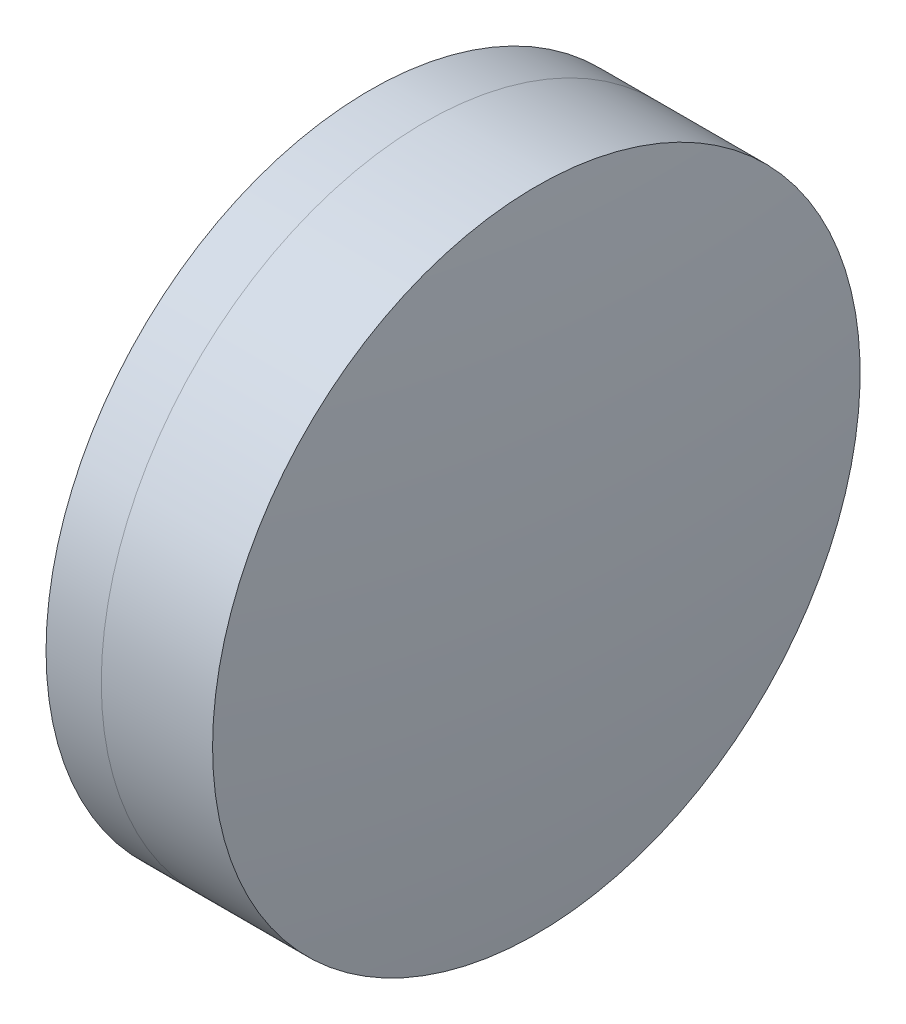
ISO-10303-21;
HEADER;
FILE_DESCRIPTION(('STEP AP214'),'2;1');
FILE_NAME('part.step','',(''),(''),'','','');
FILE_SCHEMA(('AUTOMOTIVE_DESIGN { 1 0 10303 214 1 1 1 1 }'));
ENDSEC;
DATA;
#1=APPLICATION_CONTEXT('core data for automotive mechanical design processes');
#2=APPLICATION_PROTOCOL_DEFINITION('international standard','automotive_design',2000,#1);
#3=PRODUCT_CONTEXT('',#1,'mechanical');
#4=PRODUCT('Part','Part','',(#3));
#5=PRODUCT_RELATED_PRODUCT_CATEGORY('part','',(#4));
#6=PRODUCT_DEFINITION_FORMATION('','',#4);
#7=PRODUCT_DEFINITION_CONTEXT('part definition',#1,'design');
#8=PRODUCT_DEFINITION('design','',#6,#7);
#9=PRODUCT_DEFINITION_SHAPE('','',#8);
#10=(LENGTH_UNIT() NAMED_UNIT(*) SI_UNIT(.MILLI.,.METRE.));
#11=(NAMED_UNIT(*) PLANE_ANGLE_UNIT() SI_UNIT($,.RADIAN.));
#12=(NAMED_UNIT(*) SI_UNIT($,.STERADIAN.) SOLID_ANGLE_UNIT());
#13=UNCERTAINTY_MEASURE_WITH_UNIT(LENGTH_MEASURE(1.E-05),#10,'distance_accuracy_value','');
#14=(GEOMETRIC_REPRESENTATION_CONTEXT(3) GLOBAL_UNCERTAINTY_ASSIGNED_CONTEXT((#13)) GLOBAL_UNIT_ASSIGNED_CONTEXT((#10,
#11,#12)) REPRESENTATION_CONTEXT('',''));
#15=CARTESIAN_POINT('',(0.,0.,0.));
#16=DIRECTION('',(0.,0.,1.));
#17=DIRECTION('',(1.,0.,0.));
#18=AXIS2_PLACEMENT_3D('',#15,#16,#17);
#19=CARTESIAN_POINT('',(6.12504347957313,0.,0.));
#20=DIRECTION('',(-1.,0.,0.));
#21=DIRECTION('',(0.,0.,1.));
#22=AXIS2_PLACEMENT_3D('',#19,#20,#21);
#23=SPHERICAL_SURFACE('',#22,23.31);
#24=CARTESIAN_POINT('',(28.0192459085268,0.,0.));
#25=DIRECTION('',(-1.,0.,0.));
#26=DIRECTION('',(0.,0.,1.));
#27=AXIS2_PLACEMENT_3D('',#24,#25,#26);
#28=CIRCLE('',#27,8.);
#29=CARTESIAN_POINT('',(28.0192459085268,0.,8.));
#30=VERTEX_POINT('',#29);
#31=EDGE_CURVE('E11',#30,#30,#28,.T.);
#32=ORIENTED_EDGE('',*,*,#31,.T.);
#33=EDGE_LOOP('',(#32));
#34=FACE_BOUND('',#33,.T.);
#35=ADVANCED_FACE('F43',(#34),#23,.F.);
#36=CARTESIAN_POINT('',(-0.551919992657797,0.,0.));
#37=DIRECTION('',(-1.,0.,0.));
#38=DIRECTION('',(0.,0.,1.));
#39=AXIS2_PLACEMENT_3D('',#36,#37,#38);
#40=CYLINDRICAL_SURFACE('',#39,8.);
#41=CARTESIAN_POINT('',(30.7695364349293,0.,0.));
#42=DIRECTION('',(-1.,0.,0.));
#43=DIRECTION('',(0.,0.,1.));
#44=AXIS2_PLACEMENT_3D('',#41,#42,#43);
#45=CIRCLE('',#44,7.99999999999999);
#46=CARTESIAN_POINT('',(30.7695364349293,0.,7.99999999999999));
#47=VERTEX_POINT('',#46);
#48=EDGE_CURVE('E49',#47,#47,#45,.T.);
#49=ORIENTED_EDGE('',*,*,#48,.T.);
#50=EDGE_LOOP('',(#49));
#51=FACE_BOUND('',#50,.T.);
#52=ORIENTED_EDGE('',*,*,#31,.F.);
#53=EDGE_LOOP('',(#52));
#54=FACE_BOUND('',#53,.T.);
#55=ADVANCED_FACE('F55',(#51,#54),#40,.T.);
#56=CARTESIAN_POINT('',(-37.7399565204269,0.,0.));
#57=DIRECTION('',(-1.,0.,0.));
#58=DIRECTION('',(0.,0.,1.));
#59=AXIS2_PLACEMENT_3D('',#56,#57,#58);
#60=SPHERICAL_SURFACE('',#59,68.975);
#61=ORIENTED_EDGE('',*,*,#48,.F.);
#62=EDGE_LOOP('',(#61));
#63=FACE_BOUND('',#62,.T.);
#64=ADVANCED_FACE('F58',(#63),#60,.T.);
#65=CLOSED_SHELL('',(#35,#55,#64));
#66=MANIFOLD_SOLID_BREP('B2',#65);
#67=CARTESIAN_POINT('',(57.5230434795731,0.,0.));
#68=DIRECTION('',(-1.,0.,0.));
#69=DIRECTION('',(0.,0.,1.));
#70=AXIS2_PLACEMENT_3D('',#67,#68,#69);
#71=SPHERICAL_SURFACE('',#70,31.888);
#72=CARTESIAN_POINT('',(26.6548633582896,0.,0.));
#73=DIRECTION('',(-1.,0.,0.));
#74=DIRECTION('',(0.,0.,1.));
#75=AXIS2_PLACEMENT_3D('',#72,#73,#74);
#76=CIRCLE('',#75,8.);
#77=CARTESIAN_POINT('',(26.6548633582896,0.,8.));
#78=VERTEX_POINT('',#77);
#79=EDGE_CURVE('E42',#78,#78,#76,.T.);
#80=ORIENTED_EDGE('',*,*,#79,.T.);
#81=EDGE_LOOP('',(#80));
#82=FACE_BOUND('',#81,.T.);
#83=ADVANCED_FACE('F84',(#82),#71,.T.);
#84=CARTESIAN_POINT('',(-9.70261217833668,0.,0.));
#85=DIRECTION('',(-1.,0.,0.));
#86=DIRECTION('',(0.,0.,1.));
#87=AXIS2_PLACEMENT_3D('',#84,#85,#86);
#88=CYLINDRICAL_SURFACE('',#87,8.);
#89=CARTESIAN_POINT('',(28.0192459085268,0.,0.));
#90=DIRECTION('',(-1.,0.,0.));
#91=DIRECTION('',(0.,0.,1.));
#92=AXIS2_PLACEMENT_3D('',#89,#90,#91);
#93=CIRCLE('',#92,8.);
#94=CARTESIAN_POINT('',(28.0192459085268,0.,8.));
#95=VERTEX_POINT('',#94);
#96=EDGE_CURVE('E90',#95,#95,#93,.T.);
#97=ORIENTED_EDGE('',*,*,#96,.T.);
#98=EDGE_LOOP('',(#97));
#99=FACE_BOUND('',#98,.T.);
#100=ORIENTED_EDGE('',*,*,#79,.F.);
#101=EDGE_LOOP('',(#100));
#102=FACE_BOUND('',#101,.T.);
#103=ADVANCED_FACE('F96',(#99,#102),#88,.T.);
#104=CARTESIAN_POINT('',(6.12504347957313,0.,0.));
#105=DIRECTION('',(-1.,0.,0.));
#106=DIRECTION('',(0.,0.,1.));
#107=AXIS2_PLACEMENT_3D('',#104,#105,#106);
#108=SPHERICAL_SURFACE('',#107,23.31);
#109=ORIENTED_EDGE('',*,*,#96,.F.);
#110=EDGE_LOOP('',(#109));
#111=FACE_BOUND('',#110,.T.);
#112=ADVANCED_FACE('F99',(#111),#108,.T.);
#113=CLOSED_SHELL('',(#83,#103,#112));
#114=MANIFOLD_SOLID_BREP('B6',#113);
#115=ADVANCED_BREP_SHAPE_REPRESENTATION('',(#18,#66,#114),#14);
#116=SHAPE_DEFINITION_REPRESENTATION(#9,#115);
ENDSEC;
END-ISO-10303-21;
